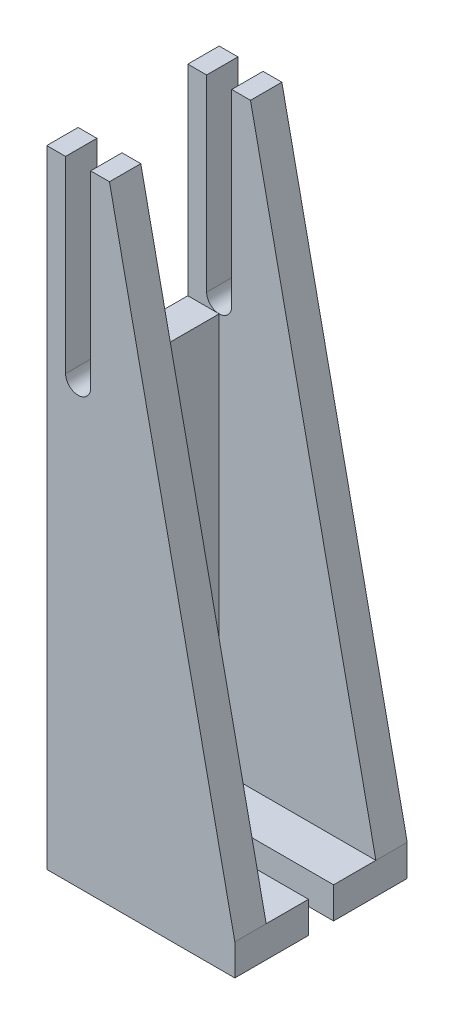
ISO-10303-21;
HEADER;
FILE_DESCRIPTION(('STEP AP214'),'2;1');
FILE_NAME('part.step','',(''),(''),'','','');
FILE_SCHEMA(('AUTOMOTIVE_DESIGN { 1 0 10303 214 1 1 1 1 }'));
ENDSEC;
DATA;
#1=APPLICATION_CONTEXT('core data for automotive mechanical design processes');
#2=APPLICATION_PROTOCOL_DEFINITION('international standard','automotive_design',2000,#1);
#3=PRODUCT_CONTEXT('',#1,'mechanical');
#4=PRODUCT('Part','Part','',(#3));
#5=PRODUCT_RELATED_PRODUCT_CATEGORY('part','',(#4));
#6=PRODUCT_DEFINITION_FORMATION('','',#4);
#7=PRODUCT_DEFINITION_CONTEXT('part definition',#1,'design');
#8=PRODUCT_DEFINITION('design','',#6,#7);
#9=PRODUCT_DEFINITION_SHAPE('','',#8);
#10=(LENGTH_UNIT() NAMED_UNIT(*) SI_UNIT(.MILLI.,.METRE.));
#11=(NAMED_UNIT(*) PLANE_ANGLE_UNIT() SI_UNIT($,.RADIAN.));
#12=(NAMED_UNIT(*) SI_UNIT($,.STERADIAN.) SOLID_ANGLE_UNIT());
#13=UNCERTAINTY_MEASURE_WITH_UNIT(LENGTH_MEASURE(1.E-05),#10,'distance_accuracy_value','');
#14=(GEOMETRIC_REPRESENTATION_CONTEXT(3) GLOBAL_UNCERTAINTY_ASSIGNED_CONTEXT((#13)) GLOBAL_UNIT_ASSIGNED_CONTEXT((#10,
#11,#12)) REPRESENTATION_CONTEXT('',''));
#15=CARTESIAN_POINT('',(0.,0.,0.));
#16=DIRECTION('',(0.,0.,1.));
#17=DIRECTION('',(1.,0.,0.));
#18=AXIS2_PLACEMENT_3D('',#15,#16,#17);
#19=CARTESIAN_POINT('',(0.,-163.564905109489,55.));
#20=DIRECTION('',(0.,1.,0.));
#21=DIRECTION('',(0.,0.,1.));
#22=AXIS2_PLACEMENT_3D('',#19,#20,#21);
#23=PLANE('',#22);
#24=DIRECTION('',(1.,0.,0.));
#25=VECTOR('',#24,1.);
#26=CARTESIAN_POINT('',(0.,-163.564905109489,31.5));
#27=LINE('',#26,#25);
#28=CARTESIAN_POINT('',(-14.1192826286553,-163.564905109489,31.5));
#29=VERTEX_POINT('',#28);
#30=CARTESIAN_POINT('',(31.8807173713447,-163.564905109489,31.5));
#31=VERTEX_POINT('',#30);
#32=EDGE_CURVE('E206',#29,#31,#27,.T.);
#33=ORIENTED_EDGE('',*,*,#32,.T.);
#34=DIRECTION('',(0.,0.,-1.));
#35=VECTOR('',#34,1.);
#36=CARTESIAN_POINT('',(31.8807173713447,-163.564905109489,55.));
#37=LINE('',#36,#35);
#38=CARTESIAN_POINT('',(31.8807173713447,-163.564905109489,55.));
#39=VERTEX_POINT('',#38);
#40=EDGE_CURVE('E354',#39,#31,#37,.T.);
#41=ORIENTED_EDGE('',*,*,#40,.F.);
#42=DIRECTION('',(1.,0.,0.));
#43=VECTOR('',#42,1.);
#44=CARTESIAN_POINT('',(0.,-163.564905109489,55.));
#45=LINE('',#44,#43);
#46=CARTESIAN_POINT('',(-28.1192826286553,-163.564905109489,55.));
#47=VERTEX_POINT('',#46);
#48=EDGE_CURVE('E300',#47,#39,#45,.T.);
#49=ORIENTED_EDGE('',*,*,#48,.F.);
#50=DIRECTION('',(0.,0.,-1.));
#51=VECTOR('',#50,1.);
#52=CARTESIAN_POINT('',(-28.1192826286553,-163.564905109489,55.));
#53=LINE('',#52,#51);
#54=CARTESIAN_POINT('',(-28.1192826286553,-163.564905109489,0.));
#55=VERTEX_POINT('',#54);
#56=EDGE_CURVE('E356',#47,#55,#53,.T.);
#57=ORIENTED_EDGE('',*,*,#56,.T.);
#58=DIRECTION('',(1.,0.,0.));
#59=VECTOR('',#58,1.);
#60=CARTESIAN_POINT('',(0.,-163.564905109489,0.));
#61=LINE('',#60,#59);
#62=CARTESIAN_POINT('',(31.8807173713447,-163.564905109489,0.));
#63=VERTEX_POINT('',#62);
#64=EDGE_CURVE('E324',#55,#63,#61,.T.);
#65=ORIENTED_EDGE('',*,*,#64,.T.);
#66=CARTESIAN_POINT('',(31.8807173713447,-163.564905109489,23.5));
#67=VERTEX_POINT('',#66);
#68=EDGE_CURVE('E353',#67,#63,#37,.T.);
#69=ORIENTED_EDGE('',*,*,#68,.F.);
#70=DIRECTION('',(-1.,0.,0.));
#71=VECTOR('',#70,1.);
#72=CARTESIAN_POINT('',(0.,-163.564905109489,23.5));
#73=LINE('',#72,#71);
#74=CARTESIAN_POINT('',(-14.1192826286553,-163.564905109489,23.5));
#75=VERTEX_POINT('',#74);
#76=EDGE_CURVE('E203',#67,#75,#73,.T.);
#77=ORIENTED_EDGE('',*,*,#76,.T.);
#78=CARTESIAN_POINT('',(-14.1192826286553,-163.564905109489,27.5));
#79=DIRECTION('',(0.,-1.,0.));
#80=DIRECTION('',(0.,0.,-1.));
#81=AXIS2_PLACEMENT_3D('',#78,#79,#80);
#82=CIRCLE('',#81,4.);
#83=EDGE_CURVE('E198',#29,#75,#82,.T.);
#84=ORIENTED_EDGE('',*,*,#83,.F.);
#85=EDGE_LOOP('',(#33,#41,#49,#57,#65,#69,#77,#84));
#86=FACE_BOUND('',#85,.T.);
#87=ADVANCED_FACE('F35',(#86),#23,.F.);
#88=CARTESIAN_POINT('',(31.8807173713447,0.,55.));
#89=DIRECTION('',(-1.,0.,0.));
#90=DIRECTION('',(0.,0.,1.));
#91=AXIS2_PLACEMENT_3D('',#88,#89,#90);
#92=PLANE('',#91);
#93=DIRECTION('',(0.,-1.,0.));
#94=VECTOR('',#93,1.);
#95=CARTESIAN_POINT('',(31.8807173713447,-133.064905109489,31.5));
#96=LINE('',#95,#94);
#97=CARTESIAN_POINT('',(31.8807173713447,-153.564905109489,31.5));
#98=VERTEX_POINT('',#97);
#99=EDGE_CURVE('E209',#98,#31,#96,.T.);
#100=ORIENTED_EDGE('',*,*,#99,.F.);
#101=DIRECTION('',(0.,0.,1.));
#102=VECTOR('',#101,1.);
#103=CARTESIAN_POINT('',(31.8807173713447,-153.564905109489,0.));
#104=LINE('',#103,#102);
#105=CARTESIAN_POINT('',(31.8807173713447,-153.564905109489,45.));
#106=VERTEX_POINT('',#105);
#107=EDGE_CURVE('E255',#98,#106,#104,.T.);
#108=ORIENTED_EDGE('',*,*,#107,.T.);
#109=DIRECTION('',(0.,0.,-1.));
#110=VECTOR('',#109,1.);
#111=CARTESIAN_POINT('',(31.8807173713447,-153.564905109489,55.));
#112=LINE('',#111,#110);
#113=CARTESIAN_POINT('',(31.8807173713447,-153.564905109489,55.));
#114=VERTEX_POINT('',#113);
#115=EDGE_CURVE('E350',#114,#106,#112,.T.);
#116=ORIENTED_EDGE('',*,*,#115,.F.);
#117=DIRECTION('',(0.,1.,0.));
#118=VECTOR('',#117,1.);
#119=CARTESIAN_POINT('',(31.8807173713447,0.,55.));
#120=LINE('',#119,#118);
#121=EDGE_CURVE('E302',#39,#114,#120,.T.);
#122=ORIENTED_EDGE('',*,*,#121,.F.);
#123=ORIENTED_EDGE('',*,*,#40,.T.);
#124=EDGE_LOOP('',(#100,#108,#116,#122,#123));
#125=FACE_BOUND('',#124,.T.);
#126=ADVANCED_FACE('F453',(#125),#92,.F.);
#127=DIRECTION('',(0.,-1.,0.));
#128=VECTOR('',#127,1.);
#129=CARTESIAN_POINT('',(31.8807173713447,-133.064905109489,23.5));
#130=LINE('',#129,#128);
#131=CARTESIAN_POINT('',(31.8807173713447,-153.564905109489,23.5));
#132=VERTEX_POINT('',#131);
#133=EDGE_CURVE('E219',#132,#67,#130,.T.);
#134=ORIENTED_EDGE('',*,*,#133,.T.);
#135=ORIENTED_EDGE('',*,*,#68,.T.);
#136=DIRECTION('',(0.,1.,0.));
#137=VECTOR('',#136,1.);
#138=CARTESIAN_POINT('',(31.8807173713447,0.,0.));
#139=LINE('',#138,#137);
#140=CARTESIAN_POINT('',(31.8807173713447,-153.564905109489,0.));
#141=VERTEX_POINT('',#140);
#142=EDGE_CURVE('E327',#63,#141,#139,.T.);
#143=ORIENTED_EDGE('',*,*,#142,.T.);
#144=CARTESIAN_POINT('',(31.8807173713447,-153.564905109489,10.));
#145=VERTEX_POINT('',#144);
#146=EDGE_CURVE('E349',#145,#141,#112,.T.);
#147=ORIENTED_EDGE('',*,*,#146,.F.);
#148=EDGE_CURVE('E260',#145,#132,#104,.T.);
#149=ORIENTED_EDGE('',*,*,#148,.T.);
#150=EDGE_LOOP('',(#134,#135,#143,#147,#149));
#151=FACE_BOUND('',#150,.T.);
#152=ADVANCED_FACE('F384',(#151),#92,.F.);
#153=CARTESIAN_POINT('',(-18.1192826286553,-153.564905109489,0.));
#154=DIRECTION('',(0.,1.,0.));
#155=DIRECTION('',(0.,0.,1.));
#156=AXIS2_PLACEMENT_3D('',#153,#154,#155);
#157=PLANE('',#156);
#158=ORIENTED_EDGE('',*,*,#107,.F.);
#159=DIRECTION('',(-1.,0.,0.));
#160=VECTOR('',#159,1.);
#161=CARTESIAN_POINT('',(-18.1192826286553,-153.564905109489,31.5));
#162=LINE('',#161,#160);
#163=CARTESIAN_POINT('',(-14.1192826286553,-153.564905109489,31.5));
#164=VERTEX_POINT('',#163);
#165=EDGE_CURVE('E11',#98,#164,#162,.T.);
#166=ORIENTED_EDGE('',*,*,#165,.T.);
#167=CARTESIAN_POINT('',(-14.1192826286553,-153.564905109489,27.5));
#168=DIRECTION('',(0.,1.,0.));
#169=DIRECTION('',(0.,0.,1.));
#170=AXIS2_PLACEMENT_3D('',#167,#168,#169);
#171=CIRCLE('',#170,4.);
#172=CARTESIAN_POINT('',(-18.1192826286553,-153.564905109489,27.5));
#173=VERTEX_POINT('',#172);
#174=EDGE_CURVE('E200',#173,#164,#171,.T.);
#175=ORIENTED_EDGE('',*,*,#174,.F.);
#176=DIRECTION('',(0.,0.,1.));
#177=VECTOR('',#176,1.);
#178=CARTESIAN_POINT('',(-18.1192826286553,-153.564905109489,0.));
#179=LINE('',#178,#177);
#180=CARTESIAN_POINT('',(-18.1192826286553,-153.564905109489,45.));
#181=VERTEX_POINT('',#180);
#182=EDGE_CURVE('E259',#173,#181,#179,.T.);
#183=ORIENTED_EDGE('',*,*,#182,.T.);
#184=DIRECTION('',(1.,0.,0.));
#185=VECTOR('',#184,1.);
#186=CARTESIAN_POINT('',(-18.1192826286553,-153.564905109489,45.));
#187=LINE('',#186,#185);
#188=EDGE_CURVE('E267',#181,#106,#187,.T.);
#189=ORIENTED_EDGE('',*,*,#188,.T.);
#190=EDGE_LOOP('',(#158,#166,#175,#183,#189));
#191=FACE_BOUND('',#190,.T.);
#192=ADVANCED_FACE('F456',(#191),#157,.T.);
#193=CARTESIAN_POINT('',(-14.1192826286553,-153.564905109489,23.5));
#194=VERTEX_POINT('',#193);
#195=EDGE_CURVE('E50',#194,#173,#171,.T.);
#196=ORIENTED_EDGE('',*,*,#195,.F.);
#197=DIRECTION('',(1.,0.,0.));
#198=VECTOR('',#197,1.);
#199=CARTESIAN_POINT('',(-18.1192826286553,-153.564905109489,23.5));
#200=LINE('',#199,#198);
#201=EDGE_CURVE('E43',#194,#132,#200,.T.);
#202=ORIENTED_EDGE('',*,*,#201,.T.);
#203=ORIENTED_EDGE('',*,*,#148,.F.);
#204=DIRECTION('',(1.,0.,0.));
#205=VECTOR('',#204,1.);
#206=CARTESIAN_POINT('',(-18.1192826286553,-153.564905109489,10.));
#207=LINE('',#206,#205);
#208=CARTESIAN_POINT('',(-18.1192826286553,-153.564905109489,10.));
#209=VERTEX_POINT('',#208);
#210=EDGE_CURVE('E270',#209,#145,#207,.T.);
#211=ORIENTED_EDGE('',*,*,#210,.F.);
#212=EDGE_CURVE('E261',#209,#173,#179,.T.);
#213=ORIENTED_EDGE('',*,*,#212,.T.);
#214=EDGE_LOOP('',(#196,#202,#203,#211,#213));
#215=FACE_BOUND('',#214,.T.);
#216=ADVANCED_FACE('F379',(#215),#157,.T.);
#217=CARTESIAN_POINT('',(-18.1192826286553,-23.5649051094891,55.));
#218=DIRECTION('',(0.,0.,-1.));
#219=DIRECTION('',(-1.,0.,0.));
#220=AXIS2_PLACEMENT_3D('',#217,#218,#219);
#221=CYLINDRICAL_SURFACE('',#220,4.);
#222=CARTESIAN_POINT('',(-18.1192826286553,-23.5649051094891,45.));
#223=DIRECTION('',(0.,0.,1.));
#224=DIRECTION('',(1.,0.,0.));
#225=AXIS2_PLACEMENT_3D('',#222,#223,#224);
#226=CIRCLE('',#225,4.);
#227=CARTESIAN_POINT('',(-18.1192826286553,-27.5649051094891,45.));
#228=VERTEX_POINT('',#227);
#229=CARTESIAN_POINT('',(-14.1192826286553,-23.5649051094891,45.));
#230=VERTEX_POINT('',#229);
#231=EDGE_CURVE('E58',#228,#230,#226,.T.);
#232=ORIENTED_EDGE('',*,*,#231,.F.);
#233=CARTESIAN_POINT('',(-18.1192826286553,-23.5649051094891,45.));
#234=DIRECTION('',(0.,0.,-1.));
#235=DIRECTION('',(-1.,0.,0.));
#236=AXIS2_PLACEMENT_3D('',#233,#234,#235);
#237=CIRCLE('',#236,4.);
#238=CARTESIAN_POINT('',(-22.1192826286553,-23.5649051094891,45.));
#239=VERTEX_POINT('',#238);
#240=EDGE_CURVE('E236',#228,#239,#237,.T.);
#241=ORIENTED_EDGE('',*,*,#240,.T.);
#242=DIRECTION('',(0.,0.,-1.));
#243=VECTOR('',#242,1.);
#244=CARTESIAN_POINT('',(-22.1192826286553,-23.5649051094891,55.));
#245=LINE('',#244,#243);
#246=CARTESIAN_POINT('',(-22.1192826286553,-23.5649051094891,55.));
#247=VERTEX_POINT('',#246);
#248=EDGE_CURVE('E368',#247,#239,#245,.T.);
#249=ORIENTED_EDGE('',*,*,#248,.F.);
#250=CARTESIAN_POINT('',(-18.1192826286553,-23.5649051094891,55.));
#251=DIRECTION('',(0.,0.,1.));
#252=DIRECTION('',(1.,0.,0.));
#253=AXIS2_PLACEMENT_3D('',#250,#251,#252);
#254=CIRCLE('',#253,4.);
#255=CARTESIAN_POINT('',(-14.1192826286553,-23.5649051094891,55.));
#256=VERTEX_POINT('',#255);
#257=EDGE_CURVE('E288',#247,#256,#254,.T.);
#258=ORIENTED_EDGE('',*,*,#257,.T.);
#259=DIRECTION('',(0.,0.,-1.));
#260=VECTOR('',#259,1.);
#261=CARTESIAN_POINT('',(-14.1192826286553,-23.5649051094891,55.));
#262=LINE('',#261,#260);
#263=EDGE_CURVE('E338',#256,#230,#262,.T.);
#264=ORIENTED_EDGE('',*,*,#263,.T.);
#265=EDGE_LOOP('',(#232,#241,#249,#258,#264));
#266=FACE_BOUND('',#265,.T.);
#267=ADVANCED_FACE('F37',(#266),#221,.F.);
#268=CARTESIAN_POINT('',(-22.1192826286553,-23.5649051094891,10.));
#269=VERTEX_POINT('',#268);
#270=CARTESIAN_POINT('',(-22.1192826286553,-23.5649051094891,0.));
#271=VERTEX_POINT('',#270);
#272=EDGE_CURVE('E367',#269,#271,#245,.T.);
#273=ORIENTED_EDGE('',*,*,#272,.F.);
#274=CARTESIAN_POINT('',(-18.1192826286553,-23.5649051094891,10.));
#275=DIRECTION('',(0.,0.,1.));
#276=DIRECTION('',(1.,0.,0.));
#277=AXIS2_PLACEMENT_3D('',#274,#275,#276);
#278=CIRCLE('',#277,4.);
#279=CARTESIAN_POINT('',(-18.1192826286553,-27.5649051094891,10.));
#280=VERTEX_POINT('',#279);
#281=EDGE_CURVE('E252',#269,#280,#278,.T.);
#282=ORIENTED_EDGE('',*,*,#281,.T.);
#283=CARTESIAN_POINT('',(-18.1192826286553,-23.5649051094891,10.));
#284=DIRECTION('',(0.,0.,-1.));
#285=DIRECTION('',(-1.,0.,0.));
#286=AXIS2_PLACEMENT_3D('',#283,#284,#285);
#287=CIRCLE('',#286,4.);
#288=CARTESIAN_POINT('',(-14.1192826286553,-23.5649051094891,10.));
#289=VERTEX_POINT('',#288);
#290=EDGE_CURVE('E284',#289,#280,#287,.T.);
#291=ORIENTED_EDGE('',*,*,#290,.F.);
#292=CARTESIAN_POINT('',(-14.1192826286553,-23.5649051094891,0.));
#293=VERTEX_POINT('',#292);
#294=EDGE_CURVE('E313',#289,#293,#262,.T.);
#295=ORIENTED_EDGE('',*,*,#294,.T.);
#296=CARTESIAN_POINT('',(-18.1192826286553,-23.5649051094891,0.));
#297=DIRECTION('',(0.,0.,1.));
#298=DIRECTION('',(1.,0.,0.));
#299=AXIS2_PLACEMENT_3D('',#296,#297,#298);
#300=CIRCLE('',#299,4.);
#301=EDGE_CURVE('E287',#271,#293,#300,.T.);
#302=ORIENTED_EDGE('',*,*,#301,.F.);
#303=EDGE_LOOP('',(#273,#282,#291,#295,#302));
#304=FACE_BOUND('',#303,.T.);
#305=ADVANCED_FACE('F406',(#304),#221,.F.);
#306=CARTESIAN_POINT('',(-22.1192826286553,0.,55.));
#307=DIRECTION('',(1.,0.,0.));
#308=DIRECTION('',(0.,0.,-1.));
#309=AXIS2_PLACEMENT_3D('',#306,#307,#308);
#310=PLANE('',#309);
#311=ORIENTED_EDGE('',*,*,#248,.T.);
#312=DIRECTION('',(0.,1.,0.));
#313=VECTOR('',#312,1.);
#314=CARTESIAN_POINT('',(-22.1192826286553,0.,45.));
#315=LINE('',#314,#313);
#316=CARTESIAN_POINT('',(-22.1192826286553,36.4350948905109,45.));
#317=VERTEX_POINT('',#316);
#318=EDGE_CURVE('E240',#239,#317,#315,.T.);
#319=ORIENTED_EDGE('',*,*,#318,.T.);
#320=DIRECTION('',(0.,0.,-1.));
#321=VECTOR('',#320,1.);
#322=CARTESIAN_POINT('',(-22.1192826286553,36.4350948905109,55.));
#323=LINE('',#322,#321);
#324=CARTESIAN_POINT('',(-22.1192826286553,36.4350948905109,55.));
#325=VERTEX_POINT('',#324);
#326=EDGE_CURVE('E364',#325,#317,#323,.T.);
#327=ORIENTED_EDGE('',*,*,#326,.F.);
#328=DIRECTION('',(0.,-1.,0.));
#329=VECTOR('',#328,1.);
#330=CARTESIAN_POINT('',(-22.1192826286553,0.,55.));
#331=LINE('',#330,#329);
#332=EDGE_CURVE('E291',#325,#247,#331,.T.);
#333=ORIENTED_EDGE('',*,*,#332,.T.);
#334=EDGE_LOOP('',(#311,#319,#327,#333));
#335=FACE_BOUND('',#334,.T.);
#336=ADVANCED_FACE('F478',(#335),#310,.T.);
#337=CARTESIAN_POINT('',(-22.1192826286553,36.4350948905109,10.));
#338=VERTEX_POINT('',#337);
#339=CARTESIAN_POINT('',(-22.1192826286553,36.4350948905109,0.));
#340=VERTEX_POINT('',#339);
#341=EDGE_CURVE('E363',#338,#340,#323,.T.);
#342=ORIENTED_EDGE('',*,*,#341,.F.);
#343=DIRECTION('',(0.,-1.,0.));
#344=VECTOR('',#343,1.);
#345=CARTESIAN_POINT('',(-22.1192826286553,0.,10.));
#346=LINE('',#345,#344);
#347=EDGE_CURVE('E249',#338,#269,#346,.T.);
#348=ORIENTED_EDGE('',*,*,#347,.T.);
#349=ORIENTED_EDGE('',*,*,#272,.T.);
#350=DIRECTION('',(0.,-1.,0.));
#351=VECTOR('',#350,1.);
#352=CARTESIAN_POINT('',(-22.1192826286553,0.,0.));
#353=LINE('',#352,#351);
#354=EDGE_CURVE('E316',#340,#271,#353,.T.);
#355=ORIENTED_EDGE('',*,*,#354,.F.);
#356=EDGE_LOOP('',(#342,#348,#349,#355));
#357=FACE_BOUND('',#356,.T.);
#358=ADVANCED_FACE('F414',(#357),#310,.T.);
#359=CARTESIAN_POINT('',(0.,36.4350948905109,55.));
#360=DIRECTION('',(0.,1.,0.));
#361=DIRECTION('',(0.,0.,1.));
#362=AXIS2_PLACEMENT_3D('',#359,#360,#361);
#363=PLANE('',#362);
#364=ORIENTED_EDGE('',*,*,#326,.T.);
#365=DIRECTION('',(-1.,0.,0.));
#366=VECTOR('',#365,1.);
#367=CARTESIAN_POINT('',(0.,36.4350948905109,45.));
#368=LINE('',#367,#366);
#369=CARTESIAN_POINT('',(-28.1192826286553,36.4350948905109,45.));
#370=VERTEX_POINT('',#369);
#371=EDGE_CURVE('E243',#317,#370,#368,.T.);
#372=ORIENTED_EDGE('',*,*,#371,.T.);
#373=DIRECTION('',(0.,0.,-1.));
#374=VECTOR('',#373,1.);
#375=CARTESIAN_POINT('',(-28.1192826286553,36.4350948905109,55.));
#376=LINE('',#375,#374);
#377=CARTESIAN_POINT('',(-28.1192826286553,36.4350948905109,55.));
#378=VERTEX_POINT('',#377);
#379=EDGE_CURVE('E360',#378,#370,#376,.T.);
#380=ORIENTED_EDGE('',*,*,#379,.F.);
#381=DIRECTION('',(1.,0.,0.));
#382=VECTOR('',#381,1.);
#383=CARTESIAN_POINT('',(0.,36.4350948905109,55.));
#384=LINE('',#383,#382);
#385=EDGE_CURVE('E295',#378,#325,#384,.T.);
#386=ORIENTED_EDGE('',*,*,#385,.T.);
#387=EDGE_LOOP('',(#364,#372,#380,#386));
#388=FACE_BOUND('',#387,.T.);
#389=ADVANCED_FACE('F475',(#388),#363,.T.);
#390=CARTESIAN_POINT('',(-28.1192826286553,36.4350948905109,10.));
#391=VERTEX_POINT('',#390);
#392=CARTESIAN_POINT('',(-28.1192826286553,36.4350948905109,0.));
#393=VERTEX_POINT('',#392);
#394=EDGE_CURVE('E359',#391,#393,#376,.T.);
#395=ORIENTED_EDGE('',*,*,#394,.F.);
#396=DIRECTION('',(1.,0.,0.));
#397=VECTOR('',#396,1.);
#398=CARTESIAN_POINT('',(0.,36.4350948905109,10.));
#399=LINE('',#398,#397);
#400=EDGE_CURVE('E246',#391,#338,#399,.T.);
#401=ORIENTED_EDGE('',*,*,#400,.T.);
#402=ORIENTED_EDGE('',*,*,#341,.T.);
#403=DIRECTION('',(1.,0.,0.));
#404=VECTOR('',#403,1.);
#405=CARTESIAN_POINT('',(0.,36.4350948905109,0.));
#406=LINE('',#405,#404);
#407=EDGE_CURVE('E319',#393,#340,#406,.T.);
#408=ORIENTED_EDGE('',*,*,#407,.F.);
#409=EDGE_LOOP('',(#395,#401,#402,#408));
#410=FACE_BOUND('',#409,.T.);
#411=ADVANCED_FACE('F419',(#410),#363,.T.);
#412=CARTESIAN_POINT('',(-28.1192826286553,0.,55.));
#413=DIRECTION('',(1.,0.,0.));
#414=DIRECTION('',(0.,0.,-1.));
#415=AXIS2_PLACEMENT_3D('',#412,#413,#414);
#416=PLANE('',#415);
#417=DIRECTION('',(0.,-1.,0.));
#418=VECTOR('',#417,1.);
#419=CARTESIAN_POINT('',(-28.1192826286553,0.,45.));
#420=LINE('',#419,#418);
#421=CARTESIAN_POINT('',(-28.1192826286553,-27.5649051094891,45.));
#422=VERTEX_POINT('',#421);
#423=EDGE_CURVE('E224',#370,#422,#420,.T.);
#424=ORIENTED_EDGE('',*,*,#423,.T.);
#425=DIRECTION('',(0.,0.,-1.));
#426=VECTOR('',#425,1.);
#427=CARTESIAN_POINT('',(-28.1192826286553,-27.5649051094891,0.));
#428=LINE('',#427,#426);
#429=CARTESIAN_POINT('',(-28.1192826286553,-27.5649051094891,10.));
#430=VERTEX_POINT('',#429);
#431=EDGE_CURVE('E230',#422,#430,#428,.T.);
#432=ORIENTED_EDGE('',*,*,#431,.T.);
#433=DIRECTION('',(0.,1.,0.));
#434=VECTOR('',#433,1.);
#435=CARTESIAN_POINT('',(-28.1192826286553,0.,10.));
#436=LINE('',#435,#434);
#437=EDGE_CURVE('E227',#430,#391,#436,.T.);
#438=ORIENTED_EDGE('',*,*,#437,.T.);
#439=ORIENTED_EDGE('',*,*,#394,.T.);
#440=DIRECTION('',(0.,-1.,0.));
#441=VECTOR('',#440,1.);
#442=CARTESIAN_POINT('',(-28.1192826286553,0.,0.));
#443=LINE('',#442,#441);
#444=EDGE_CURVE('E322',#393,#55,#443,.T.);
#445=ORIENTED_EDGE('',*,*,#444,.T.);
#446=ORIENTED_EDGE('',*,*,#56,.F.);
#447=DIRECTION('',(0.,-1.,0.));
#448=VECTOR('',#447,1.);
#449=CARTESIAN_POINT('',(-28.1192826286553,0.,55.));
#450=LINE('',#449,#448);
#451=EDGE_CURVE('E298',#378,#47,#450,.T.);
#452=ORIENTED_EDGE('',*,*,#451,.F.);
#453=ORIENTED_EDGE('',*,*,#379,.T.);
#454=EDGE_LOOP('',(#424,#432,#438,#439,#445,#446,#452,#453));
#455=FACE_BOUND('',#454,.T.);
#456=ADVANCED_FACE('F421',(#455),#416,.F.);
#457=CARTESIAN_POINT('',(-0.42969182298604,-0.0904614364181138,55.));
#458=DIRECTION('',(0.978549784986749,0.206010481049842,0.));
#459=DIRECTION('',(-0.206010481049842,0.978549784986749,0.));
#460=AXIS2_PLACEMENT_3D('',#457,#458,#459);
#461=PLANE('',#460);
#462=DIRECTION('',(-0.206010481049842,0.978549784986749,0.));
#463=VECTOR('',#462,1.);
#464=CARTESIAN_POINT('',(-0.42969182298604,-0.0904614364181138,10.));
#465=LINE('',#464,#463);
#466=CARTESIAN_POINT('',(-8.11928262865532,36.4350948905109,10.));
#467=VERTEX_POINT('',#466);
#468=EDGE_CURVE('E282',#145,#467,#465,.T.);
#469=ORIENTED_EDGE('',*,*,#468,.F.);
#470=ORIENTED_EDGE('',*,*,#146,.T.);
#471=DIRECTION('',(0.206010481049842,-0.978549784986749,0.));
#472=VECTOR('',#471,1.);
#473=CARTESIAN_POINT('',(-0.42969182298604,-0.0904614364181138,0.));
#474=LINE('',#473,#472);
#475=CARTESIAN_POINT('',(-8.11928262865532,36.4350948905109,0.));
#476=VERTEX_POINT('',#475);
#477=EDGE_CURVE('E330',#476,#141,#474,.T.);
#478=ORIENTED_EDGE('',*,*,#477,.F.);
#479=DIRECTION('',(0.,0.,-1.));
#480=VECTOR('',#479,1.);
#481=CARTESIAN_POINT('',(-8.11928262865532,36.4350948905109,55.));
#482=LINE('',#481,#480);
#483=EDGE_CURVE('E345',#467,#476,#482,.T.);
#484=ORIENTED_EDGE('',*,*,#483,.F.);
#485=EDGE_LOOP('',(#469,#470,#478,#484));
#486=FACE_BOUND('',#485,.T.);
#487=ADVANCED_FACE('F388',(#486),#461,.T.);
#488=CARTESIAN_POINT('',(0.,36.4350948905109,55.));
#489=DIRECTION('',(0.,1.,0.));
#490=DIRECTION('',(0.,0.,1.));
#491=AXIS2_PLACEMENT_3D('',#488,#489,#490);
#492=PLANE('',#491);
#493=DIRECTION('',(-1.,0.,0.));
#494=VECTOR('',#493,1.);
#495=CARTESIAN_POINT('',(0.,36.4350948905109,10.));
#496=LINE('',#495,#494);
#497=CARTESIAN_POINT('',(-14.1192826286553,36.4350948905109,10.));
#498=VERTEX_POINT('',#497);
#499=EDGE_CURVE('E280',#467,#498,#496,.T.);
#500=ORIENTED_EDGE('',*,*,#499,.F.);
#501=ORIENTED_EDGE('',*,*,#483,.T.);
#502=DIRECTION('',(1.,0.,0.));
#503=VECTOR('',#502,1.);
#504=CARTESIAN_POINT('',(0.,36.4350948905109,0.));
#505=LINE('',#504,#503);
#506=CARTESIAN_POINT('',(-14.1192826286553,36.4350948905109,0.));
#507=VERTEX_POINT('',#506);
#508=EDGE_CURVE('E333',#507,#476,#505,.T.);
#509=ORIENTED_EDGE('',*,*,#508,.F.);
#510=DIRECTION('',(0.,0.,-1.));
#511=VECTOR('',#510,1.);
#512=CARTESIAN_POINT('',(-14.1192826286553,36.4350948905109,55.));
#513=LINE('',#512,#511);
#514=EDGE_CURVE('E341',#498,#507,#513,.T.);
#515=ORIENTED_EDGE('',*,*,#514,.F.);
#516=EDGE_LOOP('',(#500,#501,#509,#515));
#517=FACE_BOUND('',#516,.T.);
#518=ADVANCED_FACE('F397',(#517),#492,.T.);
#519=CARTESIAN_POINT('',(-14.1192826286553,0.,55.));
#520=DIRECTION('',(-1.,0.,0.));
#521=DIRECTION('',(0.,0.,1.));
#522=AXIS2_PLACEMENT_3D('',#519,#520,#521);
#523=PLANE('',#522);
#524=DIRECTION('',(0.,-1.,0.));
#525=VECTOR('',#524,1.);
#526=CARTESIAN_POINT('',(-14.1192826286553,0.,10.));
#527=LINE('',#526,#525);
#528=EDGE_CURVE('E373',#498,#289,#527,.T.);
#529=ORIENTED_EDGE('',*,*,#528,.F.);
#530=ORIENTED_EDGE('',*,*,#514,.T.);
#531=DIRECTION('',(0.,1.,0.));
#532=VECTOR('',#531,1.);
#533=CARTESIAN_POINT('',(-14.1192826286553,0.,0.));
#534=LINE('',#533,#532);
#535=EDGE_CURVE('E292',#293,#507,#534,.T.);
#536=ORIENTED_EDGE('',*,*,#535,.F.);
#537=ORIENTED_EDGE('',*,*,#294,.F.);
#538=EDGE_LOOP('',(#529,#530,#536,#537));
#539=FACE_BOUND('',#538,.T.);
#540=ADVANCED_FACE('F401',(#539),#523,.T.);
#541=DIRECTION('',(0.206010481049842,-0.978549784986749,0.));
#542=VECTOR('',#541,1.);
#543=CARTESIAN_POINT('',(-0.42969182298604,-0.0904614364181138,45.));
#544=LINE('',#543,#542);
#545=CARTESIAN_POINT('',(-8.11928262865532,36.4350948905109,45.));
#546=VERTEX_POINT('',#545);
#547=EDGE_CURVE('E276',#546,#106,#544,.T.);
#548=ORIENTED_EDGE('',*,*,#547,.F.);
#549=CARTESIAN_POINT('',(-8.11928262865532,36.4350948905109,55.));
#550=VERTEX_POINT('',#549);
#551=EDGE_CURVE('E346',#550,#546,#482,.T.);
#552=ORIENTED_EDGE('',*,*,#551,.F.);
#553=DIRECTION('',(0.206010481049842,-0.978549784986749,0.));
#554=VECTOR('',#553,1.);
#555=CARTESIAN_POINT('',(-0.42969182298604,-0.0904614364181138,55.));
#556=LINE('',#555,#554);
#557=EDGE_CURVE('E304',#550,#114,#556,.T.);
#558=ORIENTED_EDGE('',*,*,#557,.T.);
#559=ORIENTED_EDGE('',*,*,#115,.T.);
#560=EDGE_LOOP('',(#548,#552,#558,#559));
#561=FACE_BOUND('',#560,.T.);
#562=ADVANCED_FACE('F446',(#561),#461,.T.);
#563=DIRECTION('',(1.,0.,0.));
#564=VECTOR('',#563,1.);
#565=CARTESIAN_POINT('',(0.,36.4350948905109,45.));
#566=LINE('',#565,#564);
#567=CARTESIAN_POINT('',(-14.1192826286553,36.4350948905109,45.));
#568=VERTEX_POINT('',#567);
#569=EDGE_CURVE('E272',#568,#546,#566,.T.);
#570=ORIENTED_EDGE('',*,*,#569,.F.);
#571=CARTESIAN_POINT('',(-14.1192826286553,36.4350948905109,55.));
#572=VERTEX_POINT('',#571);
#573=EDGE_CURVE('E342',#572,#568,#513,.T.);
#574=ORIENTED_EDGE('',*,*,#573,.F.);
#575=DIRECTION('',(1.,0.,0.));
#576=VECTOR('',#575,1.);
#577=CARTESIAN_POINT('',(0.,36.4350948905109,55.));
#578=LINE('',#577,#576);
#579=EDGE_CURVE('E307',#572,#550,#578,.T.);
#580=ORIENTED_EDGE('',*,*,#579,.T.);
#581=ORIENTED_EDGE('',*,*,#551,.T.);
#582=EDGE_LOOP('',(#570,#574,#580,#581));
#583=FACE_BOUND('',#582,.T.);
#584=ADVANCED_FACE('F442',(#583),#492,.T.);
#585=DIRECTION('',(0.,1.,0.));
#586=VECTOR('',#585,1.);
#587=CARTESIAN_POINT('',(-14.1192826286553,0.,45.));
#588=LINE('',#587,#586);
#589=EDGE_CURVE('E371',#230,#568,#588,.T.);
#590=ORIENTED_EDGE('',*,*,#589,.F.);
#591=ORIENTED_EDGE('',*,*,#263,.F.);
#592=DIRECTION('',(0.,1.,0.));
#593=VECTOR('',#592,1.);
#594=CARTESIAN_POINT('',(-14.1192826286553,0.,55.));
#595=LINE('',#594,#593);
#596=EDGE_CURVE('E310',#256,#572,#595,.T.);
#597=ORIENTED_EDGE('',*,*,#596,.T.);
#598=ORIENTED_EDGE('',*,*,#573,.T.);
#599=EDGE_LOOP('',(#590,#591,#597,#598));
#600=FACE_BOUND('',#599,.T.);
#601=ADVANCED_FACE('F438',(#600),#523,.T.);
#602=CARTESIAN_POINT('',(0.,0.,55.));
#603=DIRECTION('',(0.,0.,1.));
#604=DIRECTION('',(1.,0.,0.));
#605=AXIS2_PLACEMENT_3D('',#602,#603,#604);
#606=PLANE('',#605);
#607=ORIENTED_EDGE('',*,*,#257,.F.);
#608=ORIENTED_EDGE('',*,*,#332,.F.);
#609=ORIENTED_EDGE('',*,*,#385,.F.);
#610=ORIENTED_EDGE('',*,*,#451,.T.);
#611=ORIENTED_EDGE('',*,*,#48,.T.);
#612=ORIENTED_EDGE('',*,*,#121,.T.);
#613=ORIENTED_EDGE('',*,*,#557,.F.);
#614=ORIENTED_EDGE('',*,*,#579,.F.);
#615=ORIENTED_EDGE('',*,*,#596,.F.);
#616=EDGE_LOOP('',(#607,#608,#609,#610,#611,#612,#613,#614,#615));
#617=FACE_BOUND('',#616,.T.);
#618=ADVANCED_FACE('F448',(#617),#606,.T.);
#619=CARTESIAN_POINT('',(0.,0.,0.));
#620=DIRECTION('',(0.,0.,1.));
#621=DIRECTION('',(1.,0.,0.));
#622=AXIS2_PLACEMENT_3D('',#619,#620,#621);
#623=PLANE('',#622);
#624=ORIENTED_EDGE('',*,*,#301,.T.);
#625=ORIENTED_EDGE('',*,*,#535,.T.);
#626=ORIENTED_EDGE('',*,*,#508,.T.);
#627=ORIENTED_EDGE('',*,*,#477,.T.);
#628=ORIENTED_EDGE('',*,*,#142,.F.);
#629=ORIENTED_EDGE('',*,*,#64,.F.);
#630=ORIENTED_EDGE('',*,*,#444,.F.);
#631=ORIENTED_EDGE('',*,*,#407,.T.);
#632=ORIENTED_EDGE('',*,*,#354,.T.);
#633=EDGE_LOOP('',(#624,#625,#626,#627,#628,#629,#630,#631,#632));
#634=FACE_BOUND('',#633,.T.);
#635=ADVANCED_FACE('F491',(#634),#623,.F.);
#636=CARTESIAN_POINT('',(-18.1192826286553,0.,10.));
#637=DIRECTION('',(0.,0.,-1.));
#638=DIRECTION('',(-1.,0.,0.));
#639=AXIS2_PLACEMENT_3D('',#636,#637,#638);
#640=PLANE('',#639);
#641=ORIENTED_EDGE('',*,*,#290,.T.);
#642=DIRECTION('',(0.,1.,0.));
#643=VECTOR('',#642,1.);
#644=CARTESIAN_POINT('',(-18.1192826286553,0.,10.));
#645=LINE('',#644,#643);
#646=EDGE_CURVE('E264',#209,#280,#645,.T.);
#647=ORIENTED_EDGE('',*,*,#646,.F.);
#648=ORIENTED_EDGE('',*,*,#210,.T.);
#649=ORIENTED_EDGE('',*,*,#468,.T.);
#650=ORIENTED_EDGE('',*,*,#499,.T.);
#651=ORIENTED_EDGE('',*,*,#528,.T.);
#652=EDGE_LOOP('',(#641,#647,#648,#649,#650,#651));
#653=FACE_BOUND('',#652,.T.);
#654=ADVANCED_FACE('F392',(#653),#640,.F.);
#655=CARTESIAN_POINT('',(-18.1192826286553,0.,45.));
#656=DIRECTION('',(0.,0.,1.));
#657=DIRECTION('',(1.,0.,0.));
#658=AXIS2_PLACEMENT_3D('',#655,#656,#657);
#659=PLANE('',#658);
#660=DIRECTION('',(0.,-1.,0.));
#661=VECTOR('',#660,1.);
#662=CARTESIAN_POINT('',(-18.1192826286553,0.,45.));
#663=LINE('',#662,#661);
#664=EDGE_CURVE('E256',#228,#181,#663,.T.);
#665=ORIENTED_EDGE('',*,*,#664,.F.);
#666=ORIENTED_EDGE('',*,*,#231,.T.);
#667=ORIENTED_EDGE('',*,*,#589,.T.);
#668=ORIENTED_EDGE('',*,*,#569,.T.);
#669=ORIENTED_EDGE('',*,*,#547,.T.);
#670=ORIENTED_EDGE('',*,*,#188,.F.);
#671=EDGE_LOOP('',(#665,#666,#667,#668,#669,#670));
#672=FACE_BOUND('',#671,.T.);
#673=ADVANCED_FACE('F433',(#672),#659,.F.);
#674=CARTESIAN_POINT('',(-18.1192826286553,0.,0.));
#675=DIRECTION('',(1.,0.,0.));
#676=DIRECTION('',(0.,0.,-1.));
#677=AXIS2_PLACEMENT_3D('',#674,#675,#676);
#678=PLANE('',#677);
#679=ORIENTED_EDGE('',*,*,#182,.F.);
#680=ORIENTED_EDGE('',*,*,#212,.F.);
#681=ORIENTED_EDGE('',*,*,#646,.T.);
#682=DIRECTION('',(0.,0.,-1.));
#683=VECTOR('',#682,1.);
#684=CARTESIAN_POINT('',(-18.1192826286553,-27.5649051094891,55.));
#685=LINE('',#684,#683);
#686=EDGE_CURVE('E375',#228,#280,#685,.T.);
#687=ORIENTED_EDGE('',*,*,#686,.F.);
#688=ORIENTED_EDGE('',*,*,#664,.T.);
#689=EDGE_LOOP('',(#679,#680,#681,#687,#688));
#690=FACE_BOUND('',#689,.T.);
#691=ADVANCED_FACE('F430',(#690),#678,.T.);
#692=CARTESIAN_POINT('',(2.38071737134468,0.,45.));
#693=DIRECTION('',(0.,0.,-1.));
#694=DIRECTION('',(-1.,0.,0.));
#695=AXIS2_PLACEMENT_3D('',#692,#693,#694);
#696=PLANE('',#695);
#697=ORIENTED_EDGE('',*,*,#318,.F.);
#698=ORIENTED_EDGE('',*,*,#240,.F.);
#699=DIRECTION('',(-1.,0.,0.));
#700=VECTOR('',#699,1.);
#701=CARTESIAN_POINT('',(2.38071737134468,-27.5649051094891,45.));
#702=LINE('',#701,#700);
#703=EDGE_CURVE('E234',#228,#422,#702,.T.);
#704=ORIENTED_EDGE('',*,*,#703,.T.);
#705=ORIENTED_EDGE('',*,*,#423,.F.);
#706=ORIENTED_EDGE('',*,*,#371,.F.);
#707=EDGE_LOOP('',(#697,#698,#704,#705,#706));
#708=FACE_BOUND('',#707,.T.);
#709=ADVANCED_FACE('F606',(#708),#696,.T.);
#710=CARTESIAN_POINT('',(2.38071737134468,-27.5649051094891,0.));
#711=DIRECTION('',(0.,1.,0.));
#712=DIRECTION('',(0.,0.,1.));
#713=AXIS2_PLACEMENT_3D('',#710,#711,#712);
#714=PLANE('',#713);
#715=DIRECTION('',(-1.,0.,0.));
#716=VECTOR('',#715,1.);
#717=CARTESIAN_POINT('',(2.38071737134468,-27.5649051094891,10.));
#718=LINE('',#717,#716);
#719=EDGE_CURVE('E233',#280,#430,#718,.T.);
#720=ORIENTED_EDGE('',*,*,#719,.T.);
#721=ORIENTED_EDGE('',*,*,#431,.F.);
#722=ORIENTED_EDGE('',*,*,#703,.F.);
#723=ORIENTED_EDGE('',*,*,#686,.T.);
#724=EDGE_LOOP('',(#720,#721,#722,#723));
#725=FACE_BOUND('',#724,.T.);
#726=ADVANCED_FACE('F425',(#725),#714,.T.);
#727=CARTESIAN_POINT('',(2.38071737134468,0.,10.));
#728=DIRECTION('',(0.,0.,1.));
#729=DIRECTION('',(1.,0.,0.));
#730=AXIS2_PLACEMENT_3D('',#727,#728,#729);
#731=PLANE('',#730);
#732=ORIENTED_EDGE('',*,*,#347,.F.);
#733=ORIENTED_EDGE('',*,*,#400,.F.);
#734=ORIENTED_EDGE('',*,*,#437,.F.);
#735=ORIENTED_EDGE('',*,*,#719,.F.);
#736=ORIENTED_EDGE('',*,*,#281,.F.);
#737=EDGE_LOOP('',(#732,#733,#734,#735,#736));
#738=FACE_BOUND('',#737,.T.);
#739=ADVANCED_FACE('F410',(#738),#731,.T.);
#740=CARTESIAN_POINT('',(0.,-133.064905109489,31.5));
#741=DIRECTION('',(0.,0.,-1.));
#742=DIRECTION('',(-1.,0.,0.));
#743=AXIS2_PLACEMENT_3D('',#740,#741,#742);
#744=PLANE('',#743);
#745=ORIENTED_EDGE('',*,*,#99,.T.);
#746=ORIENTED_EDGE('',*,*,#32,.F.);
#747=DIRECTION('',(0.,-1.,0.));
#748=VECTOR('',#747,1.);
#749=CARTESIAN_POINT('',(-14.1192826286553,-133.064905109489,31.5));
#750=LINE('',#749,#748);
#751=EDGE_CURVE('E194',#164,#29,#750,.T.);
#752=ORIENTED_EDGE('',*,*,#751,.F.);
#753=ORIENTED_EDGE('',*,*,#165,.F.);
#754=EDGE_LOOP('',(#745,#746,#752,#753));
#755=FACE_BOUND('',#754,.T.);
#756=ADVANCED_FACE('F207',(#755),#744,.T.);
#757=CARTESIAN_POINT('',(0.,-133.064905109489,23.5));
#758=DIRECTION('',(0.,0.,1.));
#759=DIRECTION('',(1.,0.,0.));
#760=AXIS2_PLACEMENT_3D('',#757,#758,#759);
#761=PLANE('',#760);
#762=DIRECTION('',(0.,-1.,0.));
#763=VECTOR('',#762,1.);
#764=CARTESIAN_POINT('',(-14.1192826286553,-133.064905109489,23.5));
#765=LINE('',#764,#763);
#766=EDGE_CURVE('E202',#194,#75,#765,.T.);
#767=ORIENTED_EDGE('',*,*,#766,.T.);
#768=ORIENTED_EDGE('',*,*,#76,.F.);
#769=ORIENTED_EDGE('',*,*,#133,.F.);
#770=ORIENTED_EDGE('',*,*,#201,.F.);
#771=EDGE_LOOP('',(#767,#768,#769,#770));
#772=FACE_BOUND('',#771,.T.);
#773=ADVANCED_FACE('F672',(#772),#761,.T.);
#774=CARTESIAN_POINT('',(-14.1192826286553,-133.064905109489,27.5));
#775=DIRECTION('',(0.,-1.,0.));
#776=DIRECTION('',(0.,0.,-1.));
#777=AXIS2_PLACEMENT_3D('',#774,#775,#776);
#778=CYLINDRICAL_SURFACE('',#777,4.);
#779=ORIENTED_EDGE('',*,*,#195,.T.);
#780=ORIENTED_EDGE('',*,*,#174,.T.);
#781=ORIENTED_EDGE('',*,*,#751,.T.);
#782=ORIENTED_EDGE('',*,*,#83,.T.);
#783=ORIENTED_EDGE('',*,*,#766,.F.);
#784=EDGE_LOOP('',(#779,#780,#781,#782,#783));
#785=FACE_BOUND('',#784,.T.);
#786=ADVANCED_FACE('F196',(#785),#778,.F.);
#787=CLOSED_SHELL('',(#87,#126,#152,#192,#216,#267,#305,#336,#358,#389,#411,#456,#487,#518,#540,
#562,#584,#601,#618,#635,#654,#673,#691,#709,#726,#739,#756,#773,#786));
#788=MANIFOLD_SOLID_BREP('B2',#787);
#789=ADVANCED_BREP_SHAPE_REPRESENTATION('',(#18,#788),#14);
#790=SHAPE_DEFINITION_REPRESENTATION(#9,#789);
ENDSEC;
END-ISO-10303-21;
